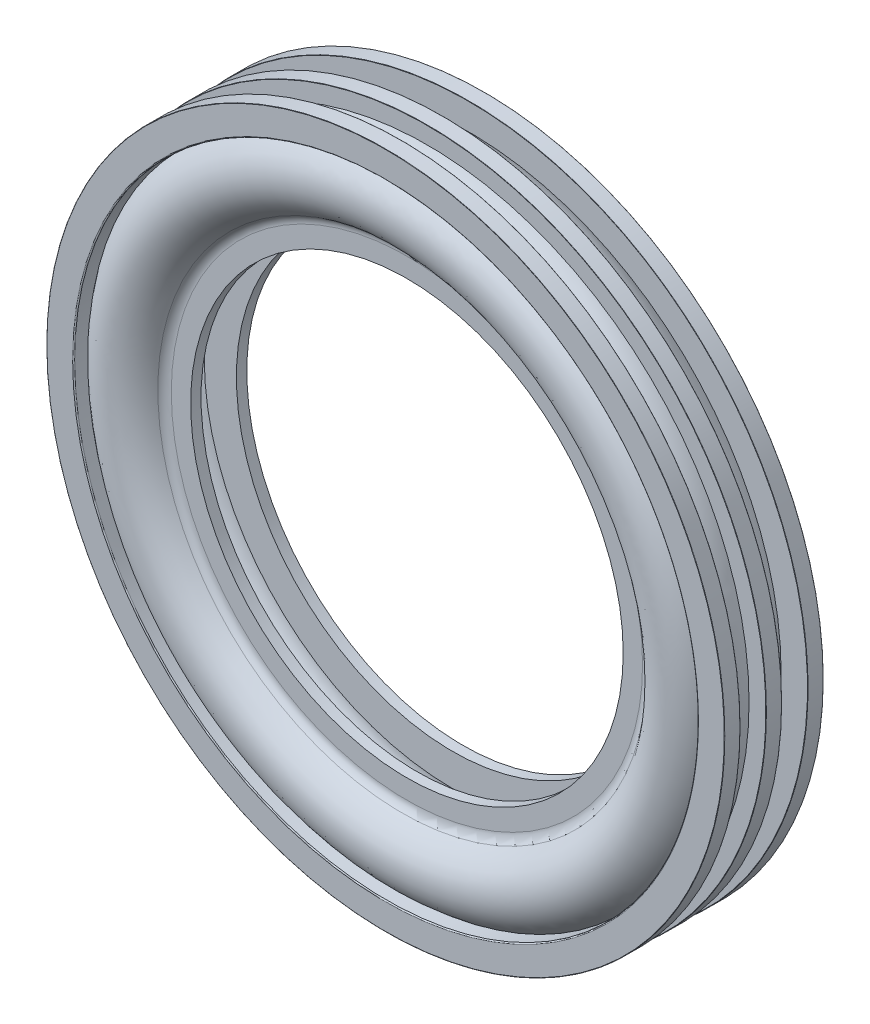
ISO-10303-21;
HEADER;
FILE_DESCRIPTION(('STEP AP214'),'2;1');
FILE_NAME('part.step','',(''),(''),'','','');
FILE_SCHEMA(('AUTOMOTIVE_DESIGN { 1 0 10303 214 1 1 1 1 }'));
ENDSEC;
DATA;
#1=APPLICATION_CONTEXT('core data for automotive mechanical design processes');
#2=APPLICATION_PROTOCOL_DEFINITION('international standard','automotive_design',2000,#1);
#3=PRODUCT_CONTEXT('',#1,'mechanical');
#4=PRODUCT('Part','Part','',(#3));
#5=PRODUCT_RELATED_PRODUCT_CATEGORY('part','',(#4));
#6=PRODUCT_DEFINITION_FORMATION('','',#4);
#7=PRODUCT_DEFINITION_CONTEXT('part definition',#1,'design');
#8=PRODUCT_DEFINITION('design','',#6,#7);
#9=PRODUCT_DEFINITION_SHAPE('','',#8);
#10=(LENGTH_UNIT() NAMED_UNIT(*) SI_UNIT(.MILLI.,.METRE.));
#11=(NAMED_UNIT(*) PLANE_ANGLE_UNIT() SI_UNIT($,.RADIAN.));
#12=(NAMED_UNIT(*) SI_UNIT($,.STERADIAN.) SOLID_ANGLE_UNIT());
#13=UNCERTAINTY_MEASURE_WITH_UNIT(LENGTH_MEASURE(1.E-05),#10,'distance_accuracy_value','');
#14=(GEOMETRIC_REPRESENTATION_CONTEXT(3) GLOBAL_UNCERTAINTY_ASSIGNED_CONTEXT((#13)) GLOBAL_UNIT_ASSIGNED_CONTEXT((#10,
#11,#12)) REPRESENTATION_CONTEXT('',''));
#15=CARTESIAN_POINT('',(0.,0.,0.));
#16=DIRECTION('',(0.,0.,1.));
#17=DIRECTION('',(1.,0.,0.));
#18=AXIS2_PLACEMENT_3D('',#15,#16,#17);
#19=CARTESIAN_POINT('',(-268.,0.,0.));
#20=DIRECTION('',(0.,1.,0.));
#21=DIRECTION('',(0.,0.,-1.));
#22=AXIS2_PLACEMENT_3D('',#19,#20,#21);
#23=ELLIPSE('',#22,51.,42.);
#24=CARTESIAN_POINT('',(0.,0.,-107.505288852726));
#25=DIRECTION('',(0.,0.,1.));
#26=AXIS1_PLACEMENT('',#24,#25);
#27=SURFACE_OF_REVOLUTION('',#23,#26);
#28=CARTESIAN_POINT('',(0.,0.,31.5578604688176));
#29=DIRECTION('',(0.,0.,1.));
#30=DIRECTION('',(1.,0.,0.));
#31=AXIS2_PLACEMENT_3D('',#28,#29,#30);
#32=CIRCLE('',#31,235.006350471811);
#33=CARTESIAN_POINT('',(235.006350471811,0.,31.5578604688176));
#34=VERTEX_POINT('',#33);
#35=EDGE_CURVE('E120',#34,#34,#32,.F.);
#36=ORIENTED_EDGE('',*,*,#35,.T.);
#37=EDGE_LOOP('',(#36));
#38=FACE_BOUND('',#37,.T.);
#39=CARTESIAN_POINT('',(0.,0.,33.032142664073));
#40=DIRECTION('',(0.,0.,1.));
#41=DIRECTION('',(1.,0.,0.));
#42=AXIS2_PLACEMENT_3D('',#39,#40,#41);
#43=CIRCLE('',#42,299.999999999999);
#44=CARTESIAN_POINT('',(299.999999999999,0.,33.032142664073));
#45=VERTEX_POINT('',#44);
#46=EDGE_CURVE('E93',#45,#45,#43,.F.);
#47=ORIENTED_EDGE('',*,*,#46,.F.);
#48=EDGE_LOOP('',(#47));
#49=FACE_BOUND('',#48,.T.);
#50=ADVANCED_FACE('F37',(#38,#49),#27,.T.);
#51=CARTESIAN_POINT('',(0.,0.,7.50000000000001));
#52=DIRECTION('',(0.,0.,1.));
#53=DIRECTION('',(1.,0.,0.));
#54=AXIS2_PLACEMENT_3D('',#51,#52,#53);
#55=CIRCLE('',#54,309.543365427859);
#56=CARTESIAN_POINT('',(309.543365427859,0.,7.50000000000001));
#57=VERTEX_POINT('',#56);
#58=EDGE_CURVE('E99',#57,#57,#55,.F.);
#59=ORIENTED_EDGE('',*,*,#58,.F.);
#60=EDGE_LOOP('',(#59));
#61=FACE_BOUND('',#60,.T.);
#62=CARTESIAN_POINT('',(0.,0.,32.5));
#63=DIRECTION('',(0.,0.,1.));
#64=DIRECTION('',(1.,0.,0.));
#65=AXIS2_PLACEMENT_3D('',#62,#63,#64);
#66=CIRCLE('',#65,300.367429910809);
#67=CARTESIAN_POINT('',(300.367429910809,0.,32.5));
#68=VERTEX_POINT('',#67);
#69=EDGE_CURVE('E96',#68,#68,#66,.T.);
#70=ORIENTED_EDGE('',*,*,#69,.F.);
#71=EDGE_LOOP('',(#70));
#72=FACE_BOUND('',#71,.T.);
#73=ADVANCED_FACE('F140',(#61,#72),#27,.T.);
#74=CARTESIAN_POINT('',(0.,0.,-32.5));
#75=DIRECTION('',(0.,0.,1.));
#76=DIRECTION('',(1.,0.,0.));
#77=AXIS2_PLACEMENT_3D('',#74,#75,#76);
#78=CIRCLE('',#77,300.367429910809);
#79=CARTESIAN_POINT('',(300.367429910809,0.,-32.5));
#80=VERTEX_POINT('',#79);
#81=EDGE_CURVE('E105',#80,#80,#78,.F.);
#82=ORIENTED_EDGE('',*,*,#81,.F.);
#83=EDGE_LOOP('',(#82));
#84=FACE_BOUND('',#83,.T.);
#85=CARTESIAN_POINT('',(0.,0.,-7.49999999999999));
#86=DIRECTION('',(0.,0.,1.));
#87=DIRECTION('',(1.,0.,0.));
#88=AXIS2_PLACEMENT_3D('',#85,#86,#87);
#89=CIRCLE('',#88,309.543365427859);
#90=CARTESIAN_POINT('',(309.543365427859,0.,-7.49999999999999));
#91=VERTEX_POINT('',#90);
#92=EDGE_CURVE('E102',#91,#91,#89,.T.);
#93=ORIENTED_EDGE('',*,*,#92,.F.);
#94=EDGE_LOOP('',(#93));
#95=FACE_BOUND('',#94,.T.);
#96=ADVANCED_FACE('F233',(#84,#95),#27,.T.);
#97=CARTESIAN_POINT('',(0.,0.,-31.5578604688176));
#98=DIRECTION('',(0.,0.,1.));
#99=DIRECTION('',(1.,0.,0.));
#100=AXIS2_PLACEMENT_3D('',#97,#98,#99);
#101=CIRCLE('',#100,235.006350471811);
#102=CARTESIAN_POINT('',(235.006350471811,0.,-31.5578604688176));
#103=VERTEX_POINT('',#102);
#104=EDGE_CURVE('E117',#103,#103,#101,.T.);
#105=ORIENTED_EDGE('',*,*,#104,.T.);
#106=EDGE_LOOP('',(#105));
#107=FACE_BOUND('',#106,.T.);
#108=CARTESIAN_POINT('',(0.,0.,-33.0321426640718));
#109=DIRECTION('',(0.,0.,1.));
#110=DIRECTION('',(1.,0.,0.));
#111=AXIS2_PLACEMENT_3D('',#108,#109,#110);
#112=CIRCLE('',#111,300.);
#113=CARTESIAN_POINT('',(300.,0.,-33.0321426640718));
#114=VERTEX_POINT('',#113);
#115=EDGE_CURVE('E108',#114,#114,#112,.T.);
#116=ORIENTED_EDGE('',*,*,#115,.F.);
#117=EDGE_LOOP('',(#116));
#118=FACE_BOUND('',#117,.T.);
#119=ADVANCED_FACE('F142',(#107,#118),#27,.T.);
#120=CARTESIAN_POINT('',(0.,0.,27.));
#121=DIRECTION('',(0.,0.,-1.));
#122=DIRECTION('',(-1.,0.,0.));
#123=AXIS2_PLACEMENT_3D('',#120,#121,#122);
#124=CYLINDRICAL_SURFACE('',#123,208.);
#125=CARTESIAN_POINT('',(0.,0.,17.));
#126=DIRECTION('',(0.,0.,1.));
#127=DIRECTION('',(1.,0.,0.));
#128=AXIS2_PLACEMENT_3D('',#125,#126,#127);
#129=CIRCLE('',#128,208.);
#130=CARTESIAN_POINT('',(208.,0.,17.));
#131=VERTEX_POINT('',#130);
#132=EDGE_CURVE('E133',#131,#131,#129,.T.);
#133=ORIENTED_EDGE('',*,*,#132,.F.);
#134=EDGE_LOOP('',(#133));
#135=FACE_BOUND('',#134,.T.);
#136=CARTESIAN_POINT('',(0.,0.,27.));
#137=DIRECTION('',(0.,0.,1.));
#138=DIRECTION('',(1.,0.,0.));
#139=AXIS2_PLACEMENT_3D('',#136,#137,#138);
#140=CIRCLE('',#139,208.);
#141=CARTESIAN_POINT('',(208.,0.,27.));
#142=VERTEX_POINT('',#141);
#143=EDGE_CURVE('E128',#142,#142,#140,.T.);
#144=ORIENTED_EDGE('',*,*,#143,.T.);
#145=EDGE_LOOP('',(#144));
#146=FACE_BOUND('',#145,.T.);
#147=ADVANCED_FACE('F162',(#135,#146),#124,.F.);
#148=CARTESIAN_POINT('',(0.,0.,-27.));
#149=DIRECTION('',(0.,0.,1.));
#150=DIRECTION('',(1.,0.,0.));
#151=AXIS2_PLACEMENT_3D('',#148,#149,#150);
#152=CYLINDRICAL_SURFACE('',#151,208.);
#153=CARTESIAN_POINT('',(0.,0.,-17.));
#154=DIRECTION('',(0.,0.,1.));
#155=DIRECTION('',(1.,0.,0.));
#156=AXIS2_PLACEMENT_3D('',#153,#154,#155);
#157=CIRCLE('',#156,208.);
#158=CARTESIAN_POINT('',(208.,0.,-17.));
#159=VERTEX_POINT('',#158);
#160=EDGE_CURVE('E123',#159,#159,#157,.T.);
#161=ORIENTED_EDGE('',*,*,#160,.T.);
#162=EDGE_LOOP('',(#161));
#163=FACE_BOUND('',#162,.T.);
#164=CARTESIAN_POINT('',(0.,0.,-27.));
#165=DIRECTION('',(0.,0.,1.));
#166=DIRECTION('',(1.,0.,0.));
#167=AXIS2_PLACEMENT_3D('',#164,#165,#166);
#168=CIRCLE('',#167,208.);
#169=CARTESIAN_POINT('',(208.,0.,-27.));
#170=VERTEX_POINT('',#169);
#171=EDGE_CURVE('E124',#170,#170,#168,.T.);
#172=ORIENTED_EDGE('',*,*,#171,.F.);
#173=EDGE_LOOP('',(#172));
#174=FACE_BOUND('',#173,.T.);
#175=ADVANCED_FACE('F158',(#163,#174),#152,.F.);
#176=CARTESIAN_POINT('',(-232.368669748356,0.,-16.9999999999999));
#177=DIRECTION('',(0.,0.,1.));
#178=DIRECTION('',(1.,0.,0.));
#179=AXIS2_PLACEMENT_3D('',#176,#177,#178);
#180=PLANE('',#179);
#181=CARTESIAN_POINT('',(0.,0.,-16.9999999999999));
#182=DIRECTION('',(0.,0.,1.));
#183=DIRECTION('',(1.,0.,0.));
#184=AXIS2_PLACEMENT_3D('',#181,#182,#183);
#185=CIRCLE('',#184,238.910641197033);
#186=CARTESIAN_POINT('',(238.910641197033,0.,-16.9999999999999));
#187=VERTEX_POINT('',#186);
#188=EDGE_CURVE('E269',#187,#187,#185,.T.);
#189=ORIENTED_EDGE('',*,*,#188,.T.);
#190=EDGE_LOOP('',(#189));
#191=FACE_BOUND('',#190,.T.);
#192=ORIENTED_EDGE('',*,*,#160,.F.);
#193=EDGE_LOOP('',(#192));
#194=FACE_BOUND('',#193,.T.);
#195=ADVANCED_FACE('F161',(#191,#194),#180,.T.);
#196=CARTESIAN_POINT('',(0.,0.,-107.505288852726));
#197=DIRECTION('',(0.,0.,1.));
#198=AXIS1_PLACEMENT('',#196,#197);
#199=SURFACE_OF_REVOLUTION('',#23,#198);
#200=OFFSET_SURFACE('',#199,-10.,.F.);
#201=CARTESIAN_POINT('',(0.,0.,16.9999999999999));
#202=DIRECTION('',(0.,0.,1.));
#203=DIRECTION('',(1.,0.,0.));
#204=AXIS2_PLACEMENT_3D('',#201,#202,#203);
#205=CIRCLE('',#204,238.910641197033);
#206=CARTESIAN_POINT('',(238.910641197033,0.,16.9999999999999));
#207=VERTEX_POINT('',#206);
#208=EDGE_CURVE('E127',#207,#207,#205,.T.);
#209=ORIENTED_EDGE('',*,*,#208,.T.);
#210=EDGE_LOOP('',(#209));
#211=FACE_BOUND('',#210,.T.);
#212=ORIENTED_EDGE('',*,*,#188,.F.);
#213=EDGE_LOOP('',(#212));
#214=FACE_BOUND('',#213,.T.);
#215=ADVANCED_FACE('F143',(#211,#214),#200,.F.);
#216=CARTESIAN_POINT('',(-232.368669748356,0.,16.9999999999999));
#217=DIRECTION('',(0.,0.,-1.));
#218=DIRECTION('',(-1.,0.,0.));
#219=AXIS2_PLACEMENT_3D('',#216,#217,#218);
#220=PLANE('',#219);
#221=ORIENTED_EDGE('',*,*,#132,.T.);
#222=EDGE_LOOP('',(#221));
#223=FACE_BOUND('',#222,.T.);
#224=ORIENTED_EDGE('',*,*,#208,.F.);
#225=EDGE_LOOP('',(#224));
#226=FACE_BOUND('',#225,.T.);
#227=ADVANCED_FACE('F145',(#223,#226),#220,.T.);
#228=CARTESIAN_POINT('',(-232.368669748356,0.,-26.9999999999999));
#229=DIRECTION('',(0.,0.,1.));
#230=DIRECTION('',(1.,0.,0.));
#231=AXIS2_PLACEMENT_3D('',#228,#229,#230);
#232=PLANE('',#231);
#233=CARTESIAN_POINT('',(0.,0.,-26.9999999999999));
#234=DIRECTION('',(0.,0.,1.));
#235=DIRECTION('',(1.,0.,0.));
#236=AXIS2_PLACEMENT_3D('',#233,#234,#235);
#237=CIRCLE('',#236,226.616885809323);
#238=CARTESIAN_POINT('',(226.616885809323,0.,-26.9999999999999));
#239=VERTEX_POINT('',#238);
#240=EDGE_CURVE('E114',#239,#239,#237,.F.);
#241=ORIENTED_EDGE('',*,*,#240,.T.);
#242=EDGE_LOOP('',(#241));
#243=FACE_BOUND('',#242,.T.);
#244=ORIENTED_EDGE('',*,*,#171,.T.);
#245=EDGE_LOOP('',(#244));
#246=FACE_BOUND('',#245,.T.);
#247=ADVANCED_FACE('F148',(#243,#246),#232,.F.);
#248=CARTESIAN_POINT('',(-232.368669748356,0.,26.9999999999999));
#249=DIRECTION('',(0.,0.,-1.));
#250=DIRECTION('',(-1.,0.,0.));
#251=AXIS2_PLACEMENT_3D('',#248,#249,#250);
#252=PLANE('',#251);
#253=CARTESIAN_POINT('',(0.,0.,26.9999999999999));
#254=DIRECTION('',(0.,0.,-1.));
#255=DIRECTION('',(-1.,0.,0.));
#256=AXIS2_PLACEMENT_3D('',#253,#254,#255);
#257=CIRCLE('',#256,226.616885809323);
#258=CARTESIAN_POINT('',(-226.616885809323,0.,26.9999999999999));
#259=VERTEX_POINT('',#258);
#260=EDGE_CURVE('E111',#259,#259,#257,.F.);
#261=ORIENTED_EDGE('',*,*,#260,.T.);
#262=EDGE_LOOP('',(#261));
#263=FACE_BOUND('',#262,.T.);
#264=ORIENTED_EDGE('',*,*,#143,.F.);
#265=EDGE_LOOP('',(#264));
#266=FACE_BOUND('',#265,.T.);
#267=ADVANCED_FACE('F150',(#263,#266),#252,.F.);
#268=CARTESIAN_POINT('',(0.,0.,-36.9999999999999));
#269=DIRECTION('',(0.,0.,1.));
#270=DIRECTION('',(1.,0.,0.));
#271=AXIS2_PLACEMENT_3D('',#268,#269,#270);
#272=TOROIDAL_SURFACE('',#271,226.616885809323,10.);
#273=ORIENTED_EDGE('',*,*,#240,.F.);
#274=EDGE_LOOP('',(#273));
#275=FACE_BOUND('',#274,.T.);
#276=ORIENTED_EDGE('',*,*,#104,.F.);
#277=EDGE_LOOP('',(#276));
#278=FACE_BOUND('',#277,.T.);
#279=ADVANCED_FACE('F153',(#275,#278),#272,.F.);
#280=CARTESIAN_POINT('',(0.,0.,36.9999999999998));
#281=DIRECTION('',(0.,0.,1.));
#282=DIRECTION('',(1.,0.,0.));
#283=AXIS2_PLACEMENT_3D('',#280,#281,#282);
#284=TOROIDAL_SURFACE('',#283,226.616885809323,10.);
#285=ORIENTED_EDGE('',*,*,#35,.F.);
#286=EDGE_LOOP('',(#285));
#287=FACE_BOUND('',#286,.T.);
#288=ORIENTED_EDGE('',*,*,#260,.F.);
#289=EDGE_LOOP('',(#288));
#290=FACE_BOUND('',#289,.T.);
#291=ADVANCED_FACE('F169',(#287,#290),#284,.F.);
#292=CARTESIAN_POINT('',(0.,0.,0.));
#293=DIRECTION('',(0.,0.,1.));
#294=DIRECTION('',(1.,0.,0.));
#295=AXIS2_PLACEMENT_3D('',#292,#293,#294);
#296=CYLINDRICAL_SURFACE('',#295,300.);
#297=CARTESIAN_POINT('',(0.,0.,-46.5));
#298=DIRECTION('',(0.,0.,1.));
#299=DIRECTION('',(1.,0.,0.));
#300=AXIS2_PLACEMENT_3D('',#297,#298,#299);
#301=CIRCLE('',#300,300.);
#302=CARTESIAN_POINT('',(300.,0.,-46.5));
#303=VERTEX_POINT('',#302);
#304=EDGE_CURVE('E48',#303,#303,#301,.F.);
#305=ORIENTED_EDGE('',*,*,#304,.T.);
#306=EDGE_LOOP('',(#305));
#307=FACE_BOUND('',#306,.T.);
#308=ORIENTED_EDGE('',*,*,#115,.T.);
#309=EDGE_LOOP('',(#308));
#310=FACE_BOUND('',#309,.T.);
#311=ADVANCED_FACE('F173',(#307,#310),#296,.F.);
#312=CARTESIAN_POINT('',(0.,0.,0.));
#313=DIRECTION('',(0.,0.,1.));
#314=DIRECTION('',(1.,0.,0.));
#315=AXIS2_PLACEMENT_3D('',#312,#313,#314);
#316=CYLINDRICAL_SURFACE('',#315,326.);
#317=CARTESIAN_POINT('',(0.,0.,-47.25));
#318=DIRECTION('',(0.,0.,1.));
#319=DIRECTION('',(1.,0.,0.));
#320=AXIS2_PLACEMENT_3D('',#317,#318,#319);
#321=CIRCLE('',#320,326.);
#322=CARTESIAN_POINT('',(326.,0.,-47.25));
#323=VERTEX_POINT('',#322);
#324=EDGE_CURVE('E87',#323,#323,#321,.T.);
#325=ORIENTED_EDGE('',*,*,#324,.T.);
#326=EDGE_LOOP('',(#325));
#327=FACE_BOUND('',#326,.T.);
#328=CARTESIAN_POINT('',(0.,0.,-32.75));
#329=DIRECTION('',(0.,0.,-1.));
#330=DIRECTION('',(-1.,0.,0.));
#331=AXIS2_PLACEMENT_3D('',#328,#329,#330);
#332=CIRCLE('',#331,326.);
#333=CARTESIAN_POINT('',(-326.,0.,-32.75));
#334=VERTEX_POINT('',#333);
#335=EDGE_CURVE('E90',#334,#334,#332,.T.);
#336=ORIENTED_EDGE('',*,*,#335,.T.);
#337=EDGE_LOOP('',(#336));
#338=FACE_BOUND('',#337,.T.);
#339=ADVANCED_FACE('F220',(#327,#338),#316,.T.);
#340=CARTESIAN_POINT('',(-326.,0.,-32.5));
#341=DIRECTION('',(0.,0.,-1.));
#342=DIRECTION('',(-1.,0.,0.));
#343=AXIS2_PLACEMENT_3D('',#340,#341,#342);
#344=PLANE('',#343);
#345=CARTESIAN_POINT('',(0.,0.,-32.5));
#346=DIRECTION('',(0.,0.,-1.));
#347=DIRECTION('',(-1.,0.,0.));
#348=AXIS2_PLACEMENT_3D('',#345,#346,#347);
#349=CIRCLE('',#348,325.75);
#350=CARTESIAN_POINT('',(-325.75,0.,-32.5));
#351=VERTEX_POINT('',#350);
#352=EDGE_CURVE('E81',#351,#351,#349,.F.);
#353=ORIENTED_EDGE('',*,*,#352,.T.);
#354=EDGE_LOOP('',(#353));
#355=FACE_BOUND('',#354,.T.);
#356=ORIENTED_EDGE('',*,*,#81,.T.);
#357=EDGE_LOOP('',(#356));
#358=FACE_BOUND('',#357,.T.);
#359=ADVANCED_FACE('F214',(#355,#358),#344,.F.);
#360=CARTESIAN_POINT('',(-326.,0.,-47.5));
#361=DIRECTION('',(0.,0.,1.));
#362=DIRECTION('',(1.,0.,0.));
#363=AXIS2_PLACEMENT_3D('',#360,#361,#362);
#364=PLANE('',#363);
#365=CARTESIAN_POINT('',(0.,0.,-47.5));
#366=DIRECTION('',(0.,0.,1.));
#367=DIRECTION('',(1.,0.,0.));
#368=AXIS2_PLACEMENT_3D('',#365,#366,#367);
#369=CIRCLE('',#368,301.);
#370=CARTESIAN_POINT('',(301.,0.,-47.5));
#371=VERTEX_POINT('',#370);
#372=EDGE_CURVE('E52',#371,#371,#369,.T.);
#373=ORIENTED_EDGE('',*,*,#372,.T.);
#374=EDGE_LOOP('',(#373));
#375=FACE_BOUND('',#374,.T.);
#376=CARTESIAN_POINT('',(0.,0.,-47.5));
#377=DIRECTION('',(0.,0.,1.));
#378=DIRECTION('',(1.,0.,0.));
#379=AXIS2_PLACEMENT_3D('',#376,#377,#378);
#380=CIRCLE('',#379,325.75);
#381=CARTESIAN_POINT('',(325.75,0.,-47.5));
#382=VERTEX_POINT('',#381);
#383=EDGE_CURVE('E84',#382,#382,#380,.F.);
#384=ORIENTED_EDGE('',*,*,#383,.T.);
#385=EDGE_LOOP('',(#384));
#386=FACE_BOUND('',#385,.T.);
#387=ADVANCED_FACE('F210',(#375,#386),#364,.F.);
#388=CARTESIAN_POINT('',(0.,0.,0.));
#389=DIRECTION('',(0.,0.,1.));
#390=DIRECTION('',(1.,0.,0.));
#391=AXIS2_PLACEMENT_3D('',#388,#389,#390);
#392=CYLINDRICAL_SURFACE('',#391,326.);
#393=CARTESIAN_POINT('',(0.,0.,-7.25));
#394=DIRECTION('',(0.,0.,1.));
#395=DIRECTION('',(1.,0.,0.));
#396=AXIS2_PLACEMENT_3D('',#393,#394,#395);
#397=CIRCLE('',#396,326.);
#398=CARTESIAN_POINT('',(326.,0.,-7.25));
#399=VERTEX_POINT('',#398);
#400=EDGE_CURVE('E75',#399,#399,#397,.T.);
#401=ORIENTED_EDGE('',*,*,#400,.T.);
#402=EDGE_LOOP('',(#401));
#403=FACE_BOUND('',#402,.T.);
#404=CARTESIAN_POINT('',(0.,0.,7.25));
#405=DIRECTION('',(0.,0.,-1.));
#406=DIRECTION('',(-1.,0.,0.));
#407=AXIS2_PLACEMENT_3D('',#404,#405,#406);
#408=CIRCLE('',#407,326.);
#409=CARTESIAN_POINT('',(-326.,0.,7.25));
#410=VERTEX_POINT('',#409);
#411=EDGE_CURVE('E78',#410,#410,#408,.T.);
#412=ORIENTED_EDGE('',*,*,#411,.T.);
#413=EDGE_LOOP('',(#412));
#414=FACE_BOUND('',#413,.T.);
#415=ADVANCED_FACE('F213',(#403,#414),#392,.T.);
#416=CARTESIAN_POINT('',(-326.,0.,7.5));
#417=DIRECTION('',(0.,0.,-1.));
#418=DIRECTION('',(-1.,0.,0.));
#419=AXIS2_PLACEMENT_3D('',#416,#417,#418);
#420=PLANE('',#419);
#421=CARTESIAN_POINT('',(0.,0.,7.5));
#422=DIRECTION('',(0.,0.,-1.));
#423=DIRECTION('',(-1.,0.,0.));
#424=AXIS2_PLACEMENT_3D('',#421,#422,#423);
#425=CIRCLE('',#424,325.75);
#426=CARTESIAN_POINT('',(-325.75,0.,7.5));
#427=VERTEX_POINT('',#426);
#428=EDGE_CURVE('E69',#427,#427,#425,.F.);
#429=ORIENTED_EDGE('',*,*,#428,.T.);
#430=EDGE_LOOP('',(#429));
#431=FACE_BOUND('',#430,.T.);
#432=ORIENTED_EDGE('',*,*,#58,.T.);
#433=EDGE_LOOP('',(#432));
#434=FACE_BOUND('',#433,.T.);
#435=ADVANCED_FACE('F241',(#431,#434),#420,.F.);
#436=CARTESIAN_POINT('',(-326.,0.,-7.5));
#437=DIRECTION('',(0.,0.,1.));
#438=DIRECTION('',(1.,0.,0.));
#439=AXIS2_PLACEMENT_3D('',#436,#437,#438);
#440=PLANE('',#439);
#441=CARTESIAN_POINT('',(0.,0.,-7.5));
#442=DIRECTION('',(0.,0.,1.));
#443=DIRECTION('',(1.,0.,0.));
#444=AXIS2_PLACEMENT_3D('',#441,#442,#443);
#445=CIRCLE('',#444,325.75);
#446=CARTESIAN_POINT('',(325.75,0.,-7.5));
#447=VERTEX_POINT('',#446);
#448=EDGE_CURVE('E72',#447,#447,#445,.F.);
#449=ORIENTED_EDGE('',*,*,#448,.T.);
#450=EDGE_LOOP('',(#449));
#451=FACE_BOUND('',#450,.T.);
#452=ORIENTED_EDGE('',*,*,#92,.T.);
#453=EDGE_LOOP('',(#452));
#454=FACE_BOUND('',#453,.T.);
#455=ADVANCED_FACE('F238',(#451,#454),#440,.F.);
#456=CARTESIAN_POINT('',(0.,0.,0.));
#457=DIRECTION('',(0.,0.,1.));
#458=DIRECTION('',(1.,0.,0.));
#459=AXIS2_PLACEMENT_3D('',#456,#457,#458);
#460=CYLINDRICAL_SURFACE('',#459,299.999999999999);
#461=CARTESIAN_POINT('',(0.,0.,46.5));
#462=DIRECTION('',(0.,0.,-1.));
#463=DIRECTION('',(-1.,0.,0.));
#464=AXIS2_PLACEMENT_3D('',#461,#462,#463);
#465=CIRCLE('',#464,299.999999999999);
#466=CARTESIAN_POINT('',(-299.999999999999,0.,46.5));
#467=VERTEX_POINT('',#466);
#468=EDGE_CURVE('E44',#467,#467,#465,.F.);
#469=ORIENTED_EDGE('',*,*,#468,.T.);
#470=EDGE_LOOP('',(#469));
#471=FACE_BOUND('',#470,.T.);
#472=ORIENTED_EDGE('',*,*,#46,.T.);
#473=EDGE_LOOP('',(#472));
#474=FACE_BOUND('',#473,.T.);
#475=ADVANCED_FACE('F240',(#471,#474),#460,.F.);
#476=CARTESIAN_POINT('',(0.,0.,0.));
#477=DIRECTION('',(0.,0.,1.));
#478=DIRECTION('',(1.,0.,0.));
#479=AXIS2_PLACEMENT_3D('',#476,#477,#478);
#480=CYLINDRICAL_SURFACE('',#479,325.999999999999);
#481=CARTESIAN_POINT('',(0.,0.,32.75));
#482=DIRECTION('',(0.,0.,1.));
#483=DIRECTION('',(1.,0.,0.));
#484=AXIS2_PLACEMENT_3D('',#481,#482,#483);
#485=CIRCLE('',#484,325.999999999999);
#486=CARTESIAN_POINT('',(325.999999999999,0.,32.75));
#487=VERTEX_POINT('',#486);
#488=EDGE_CURVE('E63',#487,#487,#485,.T.);
#489=ORIENTED_EDGE('',*,*,#488,.T.);
#490=EDGE_LOOP('',(#489));
#491=FACE_BOUND('',#490,.T.);
#492=CARTESIAN_POINT('',(0.,0.,47.25));
#493=DIRECTION('',(0.,0.,-1.));
#494=DIRECTION('',(-1.,0.,0.));
#495=AXIS2_PLACEMENT_3D('',#492,#493,#494);
#496=CIRCLE('',#495,325.999999999999);
#497=CARTESIAN_POINT('',(-325.999999999999,0.,47.25));
#498=VERTEX_POINT('',#497);
#499=EDGE_CURVE('E66',#498,#498,#496,.T.);
#500=ORIENTED_EDGE('',*,*,#499,.T.);
#501=EDGE_LOOP('',(#500));
#502=FACE_BOUND('',#501,.T.);
#503=ADVANCED_FACE('F248',(#491,#502),#480,.T.);
#504=CARTESIAN_POINT('',(-325.999999999999,0.,47.5));
#505=DIRECTION('',(0.,0.,-1.));
#506=DIRECTION('',(-1.,0.,0.));
#507=AXIS2_PLACEMENT_3D('',#504,#505,#506);
#508=PLANE('',#507);
#509=CARTESIAN_POINT('',(0.,0.,47.5));
#510=DIRECTION('',(0.,0.,-1.));
#511=DIRECTION('',(-1.,0.,0.));
#512=AXIS2_PLACEMENT_3D('',#509,#510,#511);
#513=CIRCLE('',#512,300.999999999999);
#514=CARTESIAN_POINT('',(-300.999999999999,0.,47.5));
#515=VERTEX_POINT('',#514);
#516=EDGE_CURVE('E10',#515,#515,#513,.T.);
#517=ORIENTED_EDGE('',*,*,#516,.T.);
#518=EDGE_LOOP('',(#517));
#519=FACE_BOUND('',#518,.T.);
#520=CARTESIAN_POINT('',(0.,0.,47.5));
#521=DIRECTION('',(0.,0.,-1.));
#522=DIRECTION('',(-1.,0.,0.));
#523=AXIS2_PLACEMENT_3D('',#520,#521,#522);
#524=CIRCLE('',#523,325.749999999999);
#525=CARTESIAN_POINT('',(-325.749999999999,0.,47.5));
#526=VERTEX_POINT('',#525);
#527=EDGE_CURVE('E57',#526,#526,#524,.F.);
#528=ORIENTED_EDGE('',*,*,#527,.T.);
#529=EDGE_LOOP('',(#528));
#530=FACE_BOUND('',#529,.T.);
#531=ADVANCED_FACE('F352',(#519,#530),#508,.F.);
#532=CARTESIAN_POINT('',(-325.999999999999,0.,32.5));
#533=DIRECTION('',(0.,0.,1.));
#534=DIRECTION('',(1.,0.,0.));
#535=AXIS2_PLACEMENT_3D('',#532,#533,#534);
#536=PLANE('',#535);
#537=CARTESIAN_POINT('',(0.,0.,32.5));
#538=DIRECTION('',(0.,0.,1.));
#539=DIRECTION('',(1.,0.,0.));
#540=AXIS2_PLACEMENT_3D('',#537,#538,#539);
#541=CIRCLE('',#540,325.749999999999);
#542=CARTESIAN_POINT('',(325.749999999999,0.,32.5));
#543=VERTEX_POINT('',#542);
#544=EDGE_CURVE('E60',#543,#543,#541,.F.);
#545=ORIENTED_EDGE('',*,*,#544,.T.);
#546=EDGE_LOOP('',(#545));
#547=FACE_BOUND('',#546,.T.);
#548=ORIENTED_EDGE('',*,*,#69,.T.);
#549=EDGE_LOOP('',(#548));
#550=FACE_BOUND('',#549,.T.);
#551=ADVANCED_FACE('F179',(#547,#550),#536,.F.);
#552=CARTESIAN_POINT('',(0.,0.,-47.25));
#553=DIRECTION('',(0.,0.,1.));
#554=DIRECTION('',(1.,0.,0.));
#555=AXIS2_PLACEMENT_3D('',#552,#553,#554);
#556=TOROIDAL_SURFACE('',#555,325.75,0.25);
#557=ORIENTED_EDGE('',*,*,#383,.F.);
#558=EDGE_LOOP('',(#557));
#559=FACE_BOUND('',#558,.T.);
#560=ORIENTED_EDGE('',*,*,#324,.F.);
#561=EDGE_LOOP('',(#560));
#562=FACE_BOUND('',#561,.T.);
#563=ADVANCED_FACE('F175',(#559,#562),#556,.T.);
#564=CARTESIAN_POINT('',(0.,0.,-32.75));
#565=DIRECTION('',(0.,0.,-1.));
#566=DIRECTION('',(-1.,0.,0.));
#567=AXIS2_PLACEMENT_3D('',#564,#565,#566);
#568=TOROIDAL_SURFACE('',#567,325.75,0.25);
#569=ORIENTED_EDGE('',*,*,#335,.F.);
#570=EDGE_LOOP('',(#569));
#571=FACE_BOUND('',#570,.T.);
#572=ORIENTED_EDGE('',*,*,#352,.F.);
#573=EDGE_LOOP('',(#572));
#574=FACE_BOUND('',#573,.T.);
#575=ADVANCED_FACE('F178',(#571,#574),#568,.T.);
#576=CARTESIAN_POINT('',(0.,0.,-7.25));
#577=DIRECTION('',(0.,0.,1.));
#578=DIRECTION('',(1.,0.,0.));
#579=AXIS2_PLACEMENT_3D('',#576,#577,#578);
#580=TOROIDAL_SURFACE('',#579,325.75,0.25);
#581=ORIENTED_EDGE('',*,*,#448,.F.);
#582=EDGE_LOOP('',(#581));
#583=FACE_BOUND('',#582,.T.);
#584=ORIENTED_EDGE('',*,*,#400,.F.);
#585=EDGE_LOOP('',(#584));
#586=FACE_BOUND('',#585,.T.);
#587=ADVANCED_FACE('F183',(#583,#586),#580,.T.);
#588=CARTESIAN_POINT('',(0.,0.,7.25));
#589=DIRECTION('',(0.,0.,-1.));
#590=DIRECTION('',(-1.,0.,0.));
#591=AXIS2_PLACEMENT_3D('',#588,#589,#590);
#592=TOROIDAL_SURFACE('',#591,325.75,0.25);
#593=ORIENTED_EDGE('',*,*,#411,.F.);
#594=EDGE_LOOP('',(#593));
#595=FACE_BOUND('',#594,.T.);
#596=ORIENTED_EDGE('',*,*,#428,.F.);
#597=EDGE_LOOP('',(#596));
#598=FACE_BOUND('',#597,.T.);
#599=ADVANCED_FACE('F187',(#595,#598),#592,.T.);
#600=CARTESIAN_POINT('',(0.,0.,32.75));
#601=DIRECTION('',(0.,0.,1.));
#602=DIRECTION('',(1.,0.,0.));
#603=AXIS2_PLACEMENT_3D('',#600,#601,#602);
#604=TOROIDAL_SURFACE('',#603,325.749999999999,0.25);
#605=ORIENTED_EDGE('',*,*,#544,.F.);
#606=EDGE_LOOP('',(#605));
#607=FACE_BOUND('',#606,.T.);
#608=ORIENTED_EDGE('',*,*,#488,.F.);
#609=EDGE_LOOP('',(#608));
#610=FACE_BOUND('',#609,.T.);
#611=ADVANCED_FACE('F191',(#607,#610),#604,.T.);
#612=CARTESIAN_POINT('',(0.,0.,47.25));
#613=DIRECTION('',(0.,0.,-1.));
#614=DIRECTION('',(-1.,0.,0.));
#615=AXIS2_PLACEMENT_3D('',#612,#613,#614);
#616=TOROIDAL_SURFACE('',#615,325.749999999999,0.25);
#617=ORIENTED_EDGE('',*,*,#499,.F.);
#618=EDGE_LOOP('',(#617));
#619=FACE_BOUND('',#618,.T.);
#620=ORIENTED_EDGE('',*,*,#527,.F.);
#621=EDGE_LOOP('',(#620));
#622=FACE_BOUND('',#621,.T.);
#623=ADVANCED_FACE('F195',(#619,#622),#616,.T.);
#624=CARTESIAN_POINT('',(0.,0.,-46.5));
#625=DIRECTION('',(0.,0.,1.));
#626=DIRECTION('',(1.,0.,0.));
#627=AXIS2_PLACEMENT_3D('',#624,#625,#626);
#628=TOROIDAL_SURFACE('',#627,301.,1.);
#629=ORIENTED_EDGE('',*,*,#304,.F.);
#630=EDGE_LOOP('',(#629));
#631=FACE_BOUND('',#630,.T.);
#632=ORIENTED_EDGE('',*,*,#372,.F.);
#633=EDGE_LOOP('',(#632));
#634=FACE_BOUND('',#633,.T.);
#635=ADVANCED_FACE('F198',(#631,#634),#628,.T.);
#636=CARTESIAN_POINT('',(0.,0.,46.5));
#637=DIRECTION('',(0.,0.,-1.));
#638=DIRECTION('',(-1.,0.,0.));
#639=AXIS2_PLACEMENT_3D('',#636,#637,#638);
#640=TOROIDAL_SURFACE('',#639,300.999999999999,1.);
#641=ORIENTED_EDGE('',*,*,#516,.F.);
#642=EDGE_LOOP('',(#641));
#643=FACE_BOUND('',#642,.T.);
#644=ORIENTED_EDGE('',*,*,#468,.F.);
#645=EDGE_LOOP('',(#644));
#646=FACE_BOUND('',#645,.T.);
#647=ADVANCED_FACE('F39',(#643,#646),#640,.T.);
#648=CLOSED_SHELL('',(#50,#73,#96,#119,#147,#175,#195,#215,#227,#247,#267,#279,#291,#311,#339,
#359,#387,#415,#435,#455,#475,#503,#531,#551,#563,#575,#587,#599,#611,#623,#635,#647));
#649=MANIFOLD_SOLID_BREP('B2',#648);
#650=ADVANCED_BREP_SHAPE_REPRESENTATION('',(#18,#649),#14);
#651=SHAPE_DEFINITION_REPRESENTATION(#9,#650);
ENDSEC;
END-ISO-10303-21;
